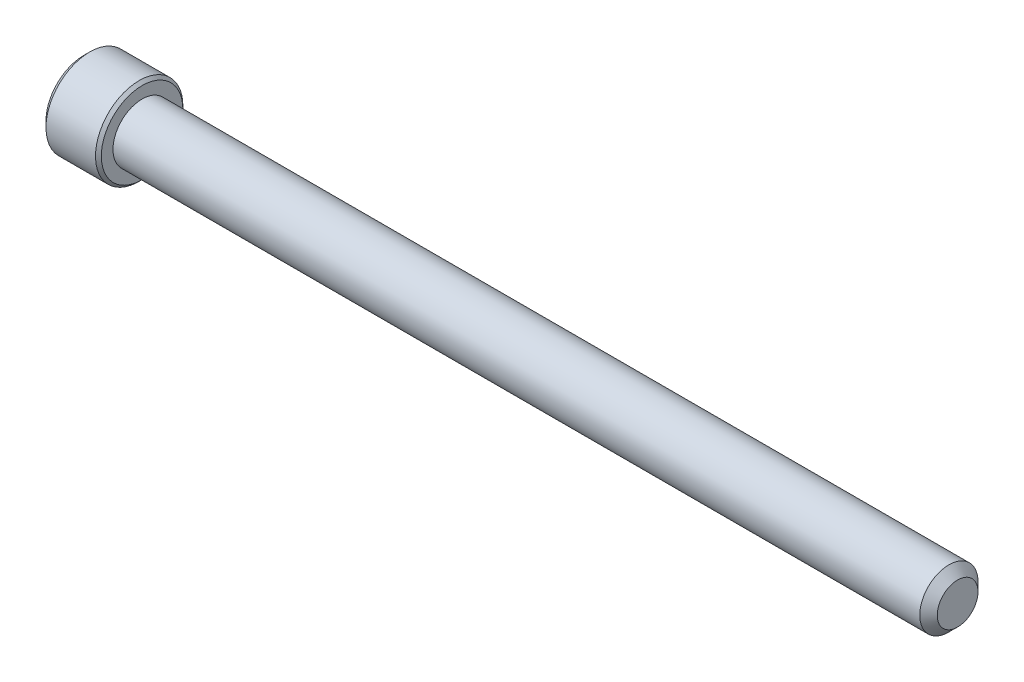
ISO-10303-21;
HEADER;
FILE_DESCRIPTION(('STEP AP214'),'2;1');
FILE_NAME('part.step','',(''),(''),'','','');
FILE_SCHEMA(('AUTOMOTIVE_DESIGN { 1 0 10303 214 1 1 1 1 }'));
ENDSEC;
DATA;
#1=APPLICATION_CONTEXT('core data for automotive mechanical design processes');
#2=APPLICATION_PROTOCOL_DEFINITION('international standard','automotive_design',2000,#1);
#3=PRODUCT_CONTEXT('',#1,'mechanical');
#4=PRODUCT('Part','Part','',(#3));
#5=PRODUCT_RELATED_PRODUCT_CATEGORY('part','',(#4));
#6=PRODUCT_DEFINITION_FORMATION('','',#4);
#7=PRODUCT_DEFINITION_CONTEXT('part definition',#1,'design');
#8=PRODUCT_DEFINITION('design','',#6,#7);
#9=PRODUCT_DEFINITION_SHAPE('','',#8);
#10=(LENGTH_UNIT() NAMED_UNIT(*) SI_UNIT(.MILLI.,.METRE.));
#11=(NAMED_UNIT(*) PLANE_ANGLE_UNIT() SI_UNIT($,.RADIAN.));
#12=(NAMED_UNIT(*) SI_UNIT($,.STERADIAN.) SOLID_ANGLE_UNIT());
#13=UNCERTAINTY_MEASURE_WITH_UNIT(LENGTH_MEASURE(1.E-05),#10,'distance_accuracy_value','');
#14=(GEOMETRIC_REPRESENTATION_CONTEXT(3) GLOBAL_UNCERTAINTY_ASSIGNED_CONTEXT((#13)) GLOBAL_UNIT_ASSIGNED_CONTEXT((#10,
#11,#12)) REPRESENTATION_CONTEXT('',''));
#15=CARTESIAN_POINT('',(0.,0.,0.));
#16=DIRECTION('',(0.,0.,1.));
#17=DIRECTION('',(1.,0.,0.));
#18=AXIS2_PLACEMENT_3D('',#15,#16,#17);
#19=CARTESIAN_POINT('',(-50.8,4.12749999999999,0.));
#20=DIRECTION('',(-1.,0.,0.));
#21=DIRECTION('',(0.,-1.,0.));
#22=AXIS2_PLACEMENT_3D('',#19,#20,#21);
#23=PLANE('',#22);
#24=CARTESIAN_POINT('',(-50.8,1.47904822880644E-13,0.));
#25=DIRECTION('',(-1.,0.,0.));
#26=DIRECTION('',(0.,-1.,0.));
#27=AXIS2_PLACEMENT_3D('',#24,#25,#26);
#28=CIRCLE('',#27,2.74963065701552);
#29=CARTESIAN_POINT('',(-50.8,-2.74963065701537,-3.89011739487799E-13));
#30=VERTEX_POINT('',#29);
#31=CARTESIAN_POINT('',(-50.8,-1.37481532850795,2.38124999999974));
#32=VERTEX_POINT('',#31);
#33=EDGE_CURVE('E132',#30,#32,#28,.T.);
#34=ORIENTED_EDGE('',*,*,#33,.F.);
#35=CARTESIAN_POINT('',(-50.8,-1.3748153285078,-2.38125));
#36=VERTEX_POINT('',#35);
#37=EDGE_CURVE('E131',#36,#30,#28,.T.);
#38=ORIENTED_EDGE('',*,*,#37,.F.);
#39=CARTESIAN_POINT('',(-50.8,1.37481532850779,-2.38125));
#40=VERTEX_POINT('',#39);
#41=EDGE_CURVE('E101',#40,#36,#28,.T.);
#42=ORIENTED_EDGE('',*,*,#41,.F.);
#43=CARTESIAN_POINT('',(-50.8,2.74963065701566,-1.22514845490862E-13));
#44=VERTEX_POINT('',#43);
#45=EDGE_CURVE('E94',#44,#40,#28,.T.);
#46=ORIENTED_EDGE('',*,*,#45,.F.);
#47=CARTESIAN_POINT('',(-50.8,1.37481532850779,2.38125));
#48=VERTEX_POINT('',#47);
#49=EDGE_CURVE('E55',#48,#44,#28,.T.);
#50=ORIENTED_EDGE('',*,*,#49,.F.);
#51=EDGE_CURVE('E62',#32,#48,#28,.T.);
#52=ORIENTED_EDGE('',*,*,#51,.F.);
#53=EDGE_LOOP('',(#34,#38,#42,#46,#50,#52));
#54=FACE_BOUND('',#53,.T.);
#55=CARTESIAN_POINT('',(-50.8,0.,0.));
#56=DIRECTION('',(1.,0.,0.));
#57=DIRECTION('',(0.,1.,0.));
#58=AXIS2_PLACEMENT_3D('',#55,#56,#57);
#59=CIRCLE('',#58,4.1275);
#60=CARTESIAN_POINT('',(-50.8,4.12749999999999,0.));
#61=VERTEX_POINT('',#60);
#62=EDGE_CURVE('E225',#61,#61,#59,.T.);
#63=ORIENTED_EDGE('',*,*,#62,.F.);
#64=EDGE_LOOP('',(#63));
#65=FACE_BOUND('',#64,.T.);
#66=ADVANCED_FACE('F35',(#54,#65),#23,.T.);
#67=CARTESIAN_POINT('',(-44.45,0.,0.));
#68=DIRECTION('',(1.,0.,0.));
#69=DIRECTION('',(0.,0.,-1.));
#70=AXIS2_PLACEMENT_3D('',#67,#68,#69);
#71=CYLINDRICAL_SURFACE('',#70,3.17499999999999);
#72=CARTESIAN_POINT('',(43.4975,0.,0.));
#73=DIRECTION('',(1.,0.,0.));
#74=DIRECTION('',(0.,0.,-1.));
#75=AXIS2_PLACEMENT_3D('',#72,#73,#74);
#76=CIRCLE('',#75,3.17499999999999);
#77=CARTESIAN_POINT('',(43.4975,0.,-3.17499999999999));
#78=VERTEX_POINT('',#77);
#79=EDGE_CURVE('E49',#78,#78,#76,.F.);
#80=ORIENTED_EDGE('',*,*,#79,.T.);
#81=EDGE_LOOP('',(#80));
#82=FACE_BOUND('',#81,.T.);
#83=CARTESIAN_POINT('',(-44.45,0.,0.));
#84=DIRECTION('',(1.,0.,0.));
#85=DIRECTION('',(0.,1.,0.));
#86=AXIS2_PLACEMENT_3D('',#83,#84,#85);
#87=CIRCLE('',#86,3.17499999999999);
#88=CARTESIAN_POINT('',(-44.45,3.17499999999998,0.));
#89=VERTEX_POINT('',#88);
#90=EDGE_CURVE('E218',#89,#89,#87,.F.);
#91=ORIENTED_EDGE('',*,*,#90,.F.);
#92=EDGE_LOOP('',(#91));
#93=FACE_BOUND('',#92,.T.);
#94=ADVANCED_FACE('F198',(#82,#93),#71,.T.);
#95=CARTESIAN_POINT('',(44.45,0.,0.));
#96=DIRECTION('',(1.,0.,0.));
#97=DIRECTION('',(0.,0.,-1.));
#98=AXIS2_PLACEMENT_3D('',#95,#96,#97);
#99=PLANE('',#98);
#100=CARTESIAN_POINT('',(44.45,0.,0.));
#101=DIRECTION('',(1.,0.,0.));
#102=DIRECTION('',(0.,0.,-1.));
#103=AXIS2_PLACEMENT_3D('',#100,#101,#102);
#104=CIRCLE('',#103,2.22249999999999);
#105=CARTESIAN_POINT('',(44.45,0.,-2.22249999999999));
#106=VERTEX_POINT('',#105);
#107=EDGE_CURVE('E219',#106,#106,#104,.T.);
#108=ORIENTED_EDGE('',*,*,#107,.T.);
#109=EDGE_LOOP('',(#108));
#110=FACE_BOUND('',#109,.T.);
#111=ADVANCED_FACE('F206',(#110),#99,.T.);
#112=CARTESIAN_POINT('',(44.45,0.,0.));
#113=DIRECTION('',(-1.,0.,0.));
#114=DIRECTION('',(0.,0.,1.));
#115=AXIS2_PLACEMENT_3D('',#112,#113,#114);
#116=CONICAL_SURFACE('',#115,2.22249999999999,0.785398163397453);
#117=ORIENTED_EDGE('',*,*,#79,.F.);
#118=EDGE_LOOP('',(#117));
#119=FACE_BOUND('',#118,.T.);
#120=ORIENTED_EDGE('',*,*,#107,.F.);
#121=EDGE_LOOP('',(#120));
#122=FACE_BOUND('',#121,.T.);
#123=ADVANCED_FACE('F37',(#119,#122),#116,.T.);
#124=CARTESIAN_POINT('',(-44.45,0.,0.));
#125=DIRECTION('',(1.,0.,0.));
#126=DIRECTION('',(0.,1.,0.));
#127=AXIS2_PLACEMENT_3D('',#124,#125,#126);
#128=CYLINDRICAL_SURFACE('',#127,4.7625);
#129=CARTESIAN_POINT('',(-50.165,0.,0.));
#130=DIRECTION('',(1.,0.,0.));
#131=DIRECTION('',(0.,1.,0.));
#132=AXIS2_PLACEMENT_3D('',#129,#130,#131);
#133=CIRCLE('',#132,4.7625);
#134=CARTESIAN_POINT('',(-50.165,4.76249999999999,0.));
#135=VERTEX_POINT('',#134);
#136=EDGE_CURVE('E220',#135,#135,#133,.T.);
#137=ORIENTED_EDGE('',*,*,#136,.T.);
#138=EDGE_LOOP('',(#137));
#139=FACE_BOUND('',#138,.T.);
#140=CARTESIAN_POINT('',(-44.7675,0.,0.));
#141=DIRECTION('',(1.,0.,0.));
#142=DIRECTION('',(0.,1.,0.));
#143=AXIS2_PLACEMENT_3D('',#140,#141,#142);
#144=CIRCLE('',#143,4.7625);
#145=CARTESIAN_POINT('',(-44.7675,4.76249999999999,0.));
#146=VERTEX_POINT('',#145);
#147=EDGE_CURVE('E233',#146,#146,#144,.T.);
#148=ORIENTED_EDGE('',*,*,#147,.F.);
#149=EDGE_LOOP('',(#148));
#150=FACE_BOUND('',#149,.T.);
#151=ADVANCED_FACE('F201',(#139,#150),#128,.T.);
#152=CARTESIAN_POINT('',(-50.165,0.,0.));
#153=DIRECTION('',(1.,0.,0.));
#154=DIRECTION('',(0.,1.,0.));
#155=AXIS2_PLACEMENT_3D('',#152,#153,#154);
#156=CONICAL_SURFACE('',#155,4.7625,0.785398163397455);
#157=ORIENTED_EDGE('',*,*,#62,.T.);
#158=EDGE_LOOP('',(#157));
#159=FACE_BOUND('',#158,.T.);
#160=ORIENTED_EDGE('',*,*,#136,.F.);
#161=EDGE_LOOP('',(#160));
#162=FACE_BOUND('',#161,.T.);
#163=ADVANCED_FACE('F194',(#159,#162),#156,.T.);
#164=CARTESIAN_POINT('',(-44.45,4.44499999999999,0.));
#165=DIRECTION('',(1.,0.,0.));
#166=DIRECTION('',(0.,1.,0.));
#167=AXIS2_PLACEMENT_3D('',#164,#165,#166);
#168=PLANE('',#167);
#169=ORIENTED_EDGE('',*,*,#90,.T.);
#170=EDGE_LOOP('',(#169));
#171=FACE_BOUND('',#170,.T.);
#172=CARTESIAN_POINT('',(-44.45,0.,0.));
#173=DIRECTION('',(1.,0.,0.));
#174=DIRECTION('',(0.,1.,0.));
#175=AXIS2_PLACEMENT_3D('',#172,#173,#174);
#176=CIRCLE('',#175,4.445);
#177=CARTESIAN_POINT('',(-44.45,4.44499999999999,0.));
#178=VERTEX_POINT('',#177);
#179=EDGE_CURVE('E230',#178,#178,#176,.T.);
#180=ORIENTED_EDGE('',*,*,#179,.T.);
#181=EDGE_LOOP('',(#180));
#182=FACE_BOUND('',#181,.T.);
#183=ADVANCED_FACE('F190',(#171,#182),#168,.T.);
#184=CARTESIAN_POINT('',(-44.45,0.,0.));
#185=DIRECTION('',(-1.,0.,0.));
#186=DIRECTION('',(0.,-1.,0.));
#187=AXIS2_PLACEMENT_3D('',#184,#185,#186);
#188=CONICAL_SURFACE('',#187,4.445,0.785398163397451);
#189=ORIENTED_EDGE('',*,*,#147,.T.);
#190=EDGE_LOOP('',(#189));
#191=FACE_BOUND('',#190,.T.);
#192=ORIENTED_EDGE('',*,*,#179,.F.);
#193=EDGE_LOOP('',(#192));
#194=FACE_BOUND('',#193,.T.);
#195=ADVANCED_FACE('F154',(#191,#194),#188,.T.);
#196=CARTESIAN_POINT('',(-50.8,1.47904822880644E-13,0.));
#197=DIRECTION('',(-1.,0.,0.));
#198=DIRECTION('',(0.,-1.,0.));
#199=AXIS2_PLACEMENT_3D('',#196,#197,#198);
#200=CONICAL_SURFACE('',#199,2.74963065701552,0.78539816339745);
#201=CARTESIAN_POINT('',(-51.697617086082,-2.76261914440425,-2.38125));
#202=CARTESIAN_POINT('',(-51.6467472146643,-2.69544479536907,-2.38125));
#203=CARTESIAN_POINT('',(-51.5963629455591,-2.62789666157828,-2.38125));
#204=CARTESIAN_POINT('',(-51.4967837708367,-2.49190448977624,-2.38125));
#205=CARTESIAN_POINT('',(-51.4475891640071,-2.42346023321907,-2.38125));
#206=CARTESIAN_POINT('',(-51.3502575507659,-2.28502676073676,-2.38125));
#207=CARTESIAN_POINT('',(-51.3021316856914,-2.21502968492298,-2.38125));
#208=CARTESIAN_POINT('',(-51.207655610134,-2.07385103549332,-2.38125));
#209=CARTESIAN_POINT('',(-51.1613052747741,-2.00266954568686,-2.38125));
#210=CARTESIAN_POINT('',(-51.0681368561697,-1.85474026844006,-2.38125));
#211=CARTESIAN_POINT('',(-51.0214491376501,-1.77790995637349,-2.38125));
#212=CARTESIAN_POINT('',(-50.9311296058592,-1.62247617017445,-2.38125));
#213=CARTESIAN_POINT('',(-50.8874973902756,-1.54387293128847,-2.38125));
#214=CARTESIAN_POINT('',(-50.8042071100283,-1.3848627213771,-2.38125));
#215=CARTESIAN_POINT('',(-50.7645379009363,-1.30446163393302,-2.38125));
#216=CARTESIAN_POINT('',(-50.6900690459264,-1.14145314547584,-2.38125));
#217=CARTESIAN_POINT('',(-50.6552671796136,-1.05884677109136,-2.38125));
#218=CARTESIAN_POINT('',(-50.594429813229,-0.898296083334491,-2.38125));
#219=CARTESIAN_POINT('',(-50.5679047139328,-0.820539229733685,-2.38125));
#220=CARTESIAN_POINT('',(-50.5210898392086,-0.663135380856678,-2.38125));
#221=CARTESIAN_POINT('',(-50.500800487612,-0.583488257498785,-2.38125));
#222=CARTESIAN_POINT('',(-50.4678604073913,-0.42411417709676,-2.38125));
#223=CARTESIAN_POINT('',(-50.4550775337026,-0.344414987504175,-2.38125));
#224=CARTESIAN_POINT('',(-50.4374018129256,-0.184141832361523,-2.38125));
#225=CARTESIAN_POINT('',(-50.4325075663142,-0.103568024531794,-2.38125));
#226=CARTESIAN_POINT('',(-50.4309814589762,0.0546452704452455,-2.38125));
#227=CARTESIAN_POINT('',(-50.4340477837949,0.132281935816241,-2.38125));
#228=CARTESIAN_POINT('',(-50.4476029014609,0.286899761817945,-2.38125));
#229=CARTESIAN_POINT('',(-50.4580924083037,0.363880858672191,-2.38125));
#230=CARTESIAN_POINT('',(-50.4860957916784,0.517934845552238,-2.38125));
#231=CARTESIAN_POINT('',(-50.5037299282364,0.594985552514308,-2.38125));
#232=CARTESIAN_POINT('',(-50.5450790150025,0.747397784971382,-2.38125));
#233=CARTESIAN_POINT('',(-50.5687934823661,0.822759444078687,-2.38125));
#234=CARTESIAN_POINT('',(-50.6521079749025,1.05910849740078,-2.38125));
#235=CARTESIAN_POINT('',(-50.7211581302676,1.21677702097605,-2.38125));
#236=CARTESIAN_POINT('',(-50.8362600462424,1.4475053891355,-2.38125));
#237=CARTESIAN_POINT('',(-50.8766390556527,1.52359597394734,-2.38125));
#238=CARTESIAN_POINT('',(-50.9605045047098,1.67404919579944,-2.38125));
#239=CARTESIAN_POINT('',(-51.0039903868604,1.74841213968931,-2.38125));
#240=CARTESIAN_POINT('',(-51.091219749271,1.89195740305355,-2.38125));
#241=CARTESIAN_POINT('',(-51.134843103173,1.96121355997418,-2.38125));
#242=CARTESIAN_POINT('',(-51.2239297072439,2.0985382616553,-2.38125));
#243=CARTESIAN_POINT('',(-51.2693930965357,2.16660671605613,-2.38125));
#244=CARTESIAN_POINT('',(-51.3614552844234,2.30115854912705,-2.38125));
#245=CARTESIAN_POINT('',(-51.4080418918462,2.3676503039009,-2.38125));
#246=CARTESIAN_POINT('',(-51.5024503249111,2.49972444191934,-2.38125));
#247=CARTESIAN_POINT('',(-51.5502718071541,2.5653070703449,-2.38125));
#248=CARTESIAN_POINT('',(-51.5985984122085,2.63050906958847,-2.38125));
#249=B_SPLINE_CURVE_WITH_KNOTS('',3,(#201,#202,#203,#204,#205,#206,#207,#208,#209,#210,#211,
#212,#213,#214,#215,#216,#217,#218,#219,#220,#221,#222,#223,#224,#225,#226,#227,#228,#229,#230,
#231,#232,#233,#234,#235,#236,#237,#238,#239,#240,#241,#242,#243,#244,#245,#246,#247,#248),
.UNSPECIFIED.,.F.,.F.,(4,2,2,2,2,2,2,2,2,2,2,2,2,2,2,2,2,2,2,2,2,2,2,4),(0.,0.252791871598845,
0.505646586890004,0.760459562213748,1.015254582946,1.2849090420233,1.55452792920376,
1.82336591151059,2.09208085189162,2.33833488227863,2.58460564635847,2.82639989379225,
3.06815123972689,3.30087188936546,3.53361492618327,3.77045005614666,4.00726638464229,
4.52203846871525,4.78044014408788,5.03879556784421,5.28431582225913,5.52985467496309,
5.77340315409188,6.01688462049009),.UNSPECIFIED.);
#250=EDGE_CURVE('E11',#36,#40,#249,.T.);
#251=ORIENTED_EDGE('',*,*,#250,.T.);
#252=ORIENTED_EDGE('',*,*,#41,.T.);
#253=EDGE_LOOP('',(#251,#252));
#254=FACE_BOUND('',#253,.T.);
#255=ADVANCED_FACE('F106',(#254),#200,.F.);
#256=CARTESIAN_POINT('',(-50.8001154773275,-2.74974612706943,0.000200000000001018));
#257=CARTESIAN_POINT('',(-50.7528948967097,-2.70248609172789,-0.0816567823790517));
#258=CARTESIAN_POINT('',(-50.7084475752931,-2.65443579722785,-0.164882333771765));
#259=CARTESIAN_POINT('',(-50.6270654569858,-2.55645590753599,-0.334588480838053));
#260=CARTESIAN_POINT('',(-50.5901759430953,-2.506516993425,-0.42108521735312));
#261=CARTESIAN_POINT('',(-50.5269834131661,-2.40581754748856,-0.595501774009069));
#262=CARTESIAN_POINT('',(-50.5005215587297,-2.35508266327637,-0.683377171180706));
#263=CARTESIAN_POINT('',(-50.4597515156163,-2.25249593653963,-0.861062594070917));
#264=CARTESIAN_POINT('',(-50.4454128915307,-2.20064722822082,-0.950867191185917));
#265=CARTESIAN_POINT('',(-50.4324757847703,-2.11128933452155,-1.10563960313039));
#266=CARTESIAN_POINT('',(-50.4305606046534,-2.07389560129141,-1.17040744896968));
#267=CARTESIAN_POINT('',(-50.4337866227679,-1.99916925388845,-1.29983727933564));
#268=CARTESIAN_POINT('',(-50.4389302948573,-1.96183666573618,-1.36449921879342));
#269=CARTESIAN_POINT('',(-50.4559813108718,-1.88752399013706,-1.49321254857747));
#270=CARTESIAN_POINT('',(-50.4678962213495,-1.85054434417196,-1.55726317423493));
#271=CARTESIAN_POINT('',(-50.4978356723522,-1.77722451768912,-1.68425683890536));
#272=CARTESIAN_POINT('',(-50.5158597445186,-1.74088428837512,-1.74719996243591));
#273=CARTESIAN_POINT('',(-50.5693688075526,-1.6478003051618,-1.90842615073226));
#274=CARTESIAN_POINT('',(-50.6088874208724,-1.59163374230434,-2.0057094912879));
#275=CARTESIAN_POINT('',(-50.675600343551,-1.50904576583586,-2.14875606262561));
#276=CARTESIAN_POINT('',(-50.6990402091115,-1.48182934348128,-2.19589628894399));
#277=CARTESIAN_POINT('',(-50.7480566766597,-1.42790064981105,-2.28930352636665));
#278=CARTESIAN_POINT('',(-50.773631966767,-1.40118808114505,-2.33557105249683));
#279=CARTESIAN_POINT('',(-50.8001154773274,-1.37469985845396,-2.38145));
#280=B_SPLINE_CURVE_WITH_KNOTS('',3,(#256,#257,#258,#259,#260,#261,#262,#263,#264,#265,#266,
#267,#268,#269,#270,#271,#272,#273,#274,#275,#276,#277,#278,#279),.UNSPECIFIED.,.F.,.F.,(4,2,2,
2,2,2,2,2,2,2,2,4),(0.,0.317196610611962,0.636241461041248,0.95021895062927,1.26340583824132,
1.48752413747852,1.71172100167756,1.93616888974092,2.16059957440847,2.51709639744768,
2.69486147369101,2.87251813383153),.UNSPECIFIED.);
#281=EDGE_CURVE('E134',#30,#36,#280,.T.);
#282=ORIENTED_EDGE('',*,*,#281,.T.);
#283=ORIENTED_EDGE('',*,*,#37,.T.);
#284=EDGE_LOOP('',(#282,#283));
#285=FACE_BOUND('',#284,.T.);
#286=ADVANCED_FACE('F153',(#285),#200,.F.);
#287=CARTESIAN_POINT('',(-50.8001154773274,-1.37469985845396,2.38145));
#288=CARTESIAN_POINT('',(-50.7528948967097,-1.4219598937955,2.29959321762095));
#289=CARTESIAN_POINT('',(-50.708447575293,-1.47001018829553,2.21636766622825));
#290=CARTESIAN_POINT('',(-50.6270654569857,-1.56799007798738,2.04666151916198));
#291=CARTESIAN_POINT('',(-50.5901759430953,-1.61792899209837,1.96016478264692));
#292=CARTESIAN_POINT('',(-50.5269834131661,-1.7186284380348,1.78574822599098));
#293=CARTESIAN_POINT('',(-50.5005215587297,-1.76936332224699,1.69787282881935));
#294=CARTESIAN_POINT('',(-50.4597515156162,-1.87195004898371,1.52018740592916));
#295=CARTESIAN_POINT('',(-50.4454128915307,-1.92379875730252,1.43038280881417));
#296=CARTESIAN_POINT('',(-50.4324757847703,-2.01315665100178,1.2756103968697));
#297=CARTESIAN_POINT('',(-50.4305606046534,-2.05055038423192,1.21084255103042));
#298=CARTESIAN_POINT('',(-50.4337866227679,-2.12527673163488,1.08141272066446));
#299=CARTESIAN_POINT('',(-50.4389302948573,-2.16260931978716,1.01675078120668));
#300=CARTESIAN_POINT('',(-50.4559813108718,-2.23692199538627,0.888037451422631));
#301=CARTESIAN_POINT('',(-50.4678962213495,-2.27390164135137,0.823986825765171));
#302=CARTESIAN_POINT('',(-50.4978356723522,-2.34722146783421,0.696993161094746));
#303=CARTESIAN_POINT('',(-50.5158597445187,-2.38356169714821,0.634050037564192));
#304=CARTESIAN_POINT('',(-50.5693688075526,-2.47664568036154,0.472823849267831));
#305=CARTESIAN_POINT('',(-50.6088874208724,-2.53281224321901,0.375540508712172));
#306=CARTESIAN_POINT('',(-50.675600343551,-2.61540021968751,0.232493937374437));
#307=CARTESIAN_POINT('',(-50.6990402091116,-2.64261664204209,0.18535371105604));
#308=CARTESIAN_POINT('',(-50.7480566766598,-2.69654533571233,0.0919464736333626));
#309=CARTESIAN_POINT('',(-50.7736319667671,-2.72325790437833,0.0456789475031789));
#310=CARTESIAN_POINT('',(-50.8001154773275,-2.74974612706943,-0.000199999999999217));
#311=B_SPLINE_CURVE_WITH_KNOTS('',3,(#287,#288,#289,#290,#291,#292,#293,#294,#295,#296,#297,
#298,#299,#300,#301,#302,#303,#304,#305,#306,#307,#308,#309,#310),.UNSPECIFIED.,.F.,.F.,(4,2,2,
2,2,2,2,2,2,2,2,4),(0.,0.317196610611931,0.636241461041185,0.950218950629172,1.26340583824119,
1.48752413747838,1.71172100167742,1.93616888974078,2.16059957440833,2.51709639744761,
2.69486147369098,2.87251813383153),.UNSPECIFIED.);
#312=EDGE_CURVE('E141',#32,#30,#311,.T.);
#313=ORIENTED_EDGE('',*,*,#312,.T.);
#314=ORIENTED_EDGE('',*,*,#33,.T.);
#315=EDGE_LOOP('',(#313,#314));
#316=FACE_BOUND('',#315,.T.);
#317=ADVANCED_FACE('F266',(#316),#200,.F.);
#318=CARTESIAN_POINT('',(-51.6976170859108,-2.76261914417831,2.38125));
#319=CARTESIAN_POINT('',(-51.6467472144997,-2.6954447951495,2.38125));
#320=CARTESIAN_POINT('',(-51.5963629454012,-2.6278966613651,2.38125));
#321=CARTESIAN_POINT('',(-51.4967837706918,-2.49190448957592,2.38125));
#322=CARTESIAN_POINT('',(-51.4475891638689,-2.4234602330252,2.38125));
#323=CARTESIAN_POINT('',(-51.3502575506408,-2.28502676055601,2.38125));
#324=CARTESIAN_POINT('',(-51.3021316855729,-2.2150296847489,2.38125));
#325=CARTESIAN_POINT('',(-51.2076556100285,-2.07385103533271,2.38125));
#326=CARTESIAN_POINT('',(-51.1613052746752,-2.00266954553304,2.38125));
#327=CARTESIAN_POINT('',(-51.0681368560842,-1.8547402683009,2.38125));
#328=CARTESIAN_POINT('',(-51.0214491375716,-1.77790995624221,2.38125));
#329=CARTESIAN_POINT('',(-50.9311296057944,-1.6224761700592,2.38125));
#330=CARTESIAN_POINT('',(-50.8874973902175,-1.54387293118138,2.38125));
#331=CARTESIAN_POINT('',(-50.804207109983,-1.38486272128662,2.38125));
#332=CARTESIAN_POINT('',(-50.764537900897,-1.304461633851,2.38125));
#333=CARTESIAN_POINT('',(-50.6900690458986,-1.14145314541117,2.38125));
#334=CARTESIAN_POINT('',(-50.6552671795912,-1.0588467710356,2.38125));
#335=CARTESIAN_POINT('',(-50.5944298132106,-0.898296083282554,2.38125));
#336=CARTESIAN_POINT('',(-50.5679047139139,-0.820539229676276,2.38125));
#337=CARTESIAN_POINT('',(-50.52108983919,-0.66313538078814,2.38125));
#338=CARTESIAN_POINT('',(-50.5008004875941,-0.583488257424592,2.38125));
#339=CARTESIAN_POINT('',(-50.4678604073762,-0.424114177011439,2.38125));
#340=CARTESIAN_POINT('',(-50.4550775336894,-0.344414987413386,2.38125));
#341=CARTESIAN_POINT('',(-50.4374018129175,-0.184141832259972,2.38125));
#342=CARTESIAN_POINT('',(-50.4325075663093,-0.10356802442495,2.38125));
#343=CARTESIAN_POINT('',(-50.4309814589787,0.0546452705617246,2.38125));
#344=CARTESIAN_POINT('',(-50.4340477838015,0.132281935937076,2.38125));
#345=CARTESIAN_POINT('',(-50.4476029014762,0.286899761947049,2.38125));
#346=CARTESIAN_POINT('',(-50.4580924083237,0.363880858805207,2.38125));
#347=CARTESIAN_POINT('',(-50.4860957917083,0.517934845692977,2.38125));
#348=CARTESIAN_POINT('',(-50.5037299282714,0.594985552658845,2.38125));
#349=CARTESIAN_POINT('',(-50.5450790150479,0.747397785123144,2.38125));
#350=CARTESIAN_POINT('',(-50.5687934824168,0.822759444233876,2.38125));
#351=CARTESIAN_POINT('',(-50.6521079749779,1.05910849758962,2.38125));
#352=CARTESIAN_POINT('',(-50.7211581303658,1.21677702119343,2.38125));
#353=CARTESIAN_POINT('',(-50.8362600463765,1.44750538939399,2.38125));
#354=CARTESIAN_POINT('',(-50.8766390557991,1.52359597421928,2.38125));
#355=CARTESIAN_POINT('',(-50.9605045048813,1.67404919609787,2.38125));
#356=CARTESIAN_POINT('',(-51.0039903870446,1.74841214000077,2.38125));
#357=CARTESIAN_POINT('',(-51.0912197494795,1.89195740338868,2.38125));
#358=CARTESIAN_POINT('',(-51.1348431033928,1.96121356032,2.38125));
#359=CARTESIAN_POINT('',(-51.2239297074865,2.09853826202233,2.38125));
#360=CARTESIAN_POINT('',(-51.2693930967897,2.1666067164337,2.38125));
#361=CARTESIAN_POINT('',(-51.3614552847003,2.30115854952543,2.38125));
#362=CARTESIAN_POINT('',(-51.4080418921344,2.36765030430956,2.38125));
#363=CARTESIAN_POINT('',(-51.5024503252218,2.4997244423485,2.38125));
#364=CARTESIAN_POINT('',(-51.5502718074761,2.56530707078428,2.38125));
#365=CARTESIAN_POINT('',(-51.5985984125418,2.63050907003805,2.38125));
#366=B_SPLINE_CURVE_WITH_KNOTS('',3,(#318,#319,#320,#321,#322,#323,#324,#325,#326,#327,#328,
#329,#330,#331,#332,#333,#334,#335,#336,#337,#338,#339,#340,#341,#342,#343,#344,#345,#346,#347,
#348,#349,#350,#351,#352,#353,#354,#355,#356,#357,#358,#359,#360,#361,#362,#363,#364,#365),
.UNSPECIFIED.,.F.,.F.,(4,2,2,2,2,2,2,2,2,2,2,2,2,2,2,2,2,2,2,2,2,2,2,4),(0.,0.252791871571654,
0.505646586835623,0.760459562131666,1.01525458283622,1.28490904188242,1.55452792903179,
1.82336591130779,2.09208085165803,2.3383348820609,2.58460564615657,2.82639989360552,
3.06815123955534,3.30087188920739,3.5336149260387,3.77045005601664,4.00726638452682,
4.52203846870511,4.78044014413077,5.03879556794011,5.28431582240037,5.52985467514967,
5.77340315432319,6.01688462076612),.UNSPECIFIED.);
#367=EDGE_CURVE('E161',#48,#32,#366,.F.);
#368=ORIENTED_EDGE('',*,*,#367,.T.);
#369=ORIENTED_EDGE('',*,*,#51,.T.);
#370=EDGE_LOOP('',(#368,#369));
#371=FACE_BOUND('',#370,.T.);
#372=ADVANCED_FACE('F282',(#371),#200,.F.);
#373=CARTESIAN_POINT('',(-50.8001154773271,2.74974612706943,-0.000199999999999819));
#374=CARTESIAN_POINT('',(-50.7528948967094,2.70248609172789,0.081656782379047));
#375=CARTESIAN_POINT('',(-50.7084475752928,2.65443579722786,0.164882333771752));
#376=CARTESIAN_POINT('',(-50.6270654569855,2.55645590753601,0.334588480838023));
#377=CARTESIAN_POINT('',(-50.590175943095,2.50651699342502,0.421085217353081));
#378=CARTESIAN_POINT('',(-50.5269834131658,2.40581754748859,0.595501774009012));
#379=CARTESIAN_POINT('',(-50.5005215587294,2.3550826632764,0.683377171180641));
#380=CARTESIAN_POINT('',(-50.459751515616,2.25249593653968,0.861062594070832));
#381=CARTESIAN_POINT('',(-50.4454128915305,2.20064722822087,0.950867191185822));
#382=CARTESIAN_POINT('',(-50.43247578477,2.11128933452161,1.10563960313028));
#383=CARTESIAN_POINT('',(-50.4305606046531,2.07389560129148,1.17040744896956));
#384=CARTESIAN_POINT('',(-50.4337866227676,1.99916925388853,1.29983727933551));
#385=CARTESIAN_POINT('',(-50.438930294857,1.96183666573626,1.36449921879328));
#386=CARTESIAN_POINT('',(-50.4559813108716,1.88752399013715,1.49321254857732));
#387=CARTESIAN_POINT('',(-50.4678962213493,1.85054434417206,1.55726317423477));
#388=CARTESIAN_POINT('',(-50.497835672352,1.77722451768922,1.68425683890519));
#389=CARTESIAN_POINT('',(-50.5158597445184,1.74088428837522,1.74719996243573));
#390=CARTESIAN_POINT('',(-50.5693688075523,1.64780030516189,1.90842615073211));
#391=CARTESIAN_POINT('',(-50.6088874208721,1.59163374230441,2.00570949128778));
#392=CARTESIAN_POINT('',(-50.6756003435507,1.5090457658359,2.14875606262553));
#393=CARTESIAN_POINT('',(-50.6990402091113,1.48182934348131,2.19589628894394));
#394=CARTESIAN_POINT('',(-50.7480566766595,1.42790064981106,2.28930352636663));
#395=CARTESIAN_POINT('',(-50.7736319667668,1.40118808114506,2.33557105249682));
#396=CARTESIAN_POINT('',(-50.8001154773272,1.37469985845396,2.38145));
#397=B_SPLINE_CURVE_WITH_KNOTS('',3,(#373,#374,#375,#376,#377,#378,#379,#380,#381,#382,#383,
#384,#385,#386,#387,#388,#389,#390,#391,#392,#393,#394,#395,#396),.UNSPECIFIED.,.F.,.F.,(4,2,2,
2,2,2,2,2,2,2,2,4),(0.,0.317196610611932,0.636241461041188,0.950218950629173,1.26340583824119,
1.48752413747836,1.71172100167738,1.93616888974072,2.16059957440825,2.51709639744758,
2.69486147369097,2.87251813383155),.UNSPECIFIED.);
#398=EDGE_CURVE('E121',#44,#48,#397,.T.);
#399=ORIENTED_EDGE('',*,*,#398,.T.);
#400=ORIENTED_EDGE('',*,*,#49,.T.);
#401=EDGE_LOOP('',(#399,#400));
#402=FACE_BOUND('',#401,.T.);
#403=ADVANCED_FACE('F258',(#402),#200,.F.);
#404=CARTESIAN_POINT('',(-50.8001154773272,1.37469985845396,-2.38145));
#405=CARTESIAN_POINT('',(-50.7528948967095,1.4219598937955,-2.29959321762095));
#406=CARTESIAN_POINT('',(-50.7084475752929,1.47001018829554,-2.21636766622823));
#407=CARTESIAN_POINT('',(-50.6270654569855,1.56799007798739,-2.04666151916195));
#408=CARTESIAN_POINT('',(-50.5901759430951,1.61792899209839,-1.96016478264688));
#409=CARTESIAN_POINT('',(-50.5269834131659,1.71862843803483,-1.78574822599093));
#410=CARTESIAN_POINT('',(-50.5005215587294,1.76936332224702,-1.6978728288193));
#411=CARTESIAN_POINT('',(-50.459751515616,1.87195004898375,-1.52018740592909));
#412=CARTESIAN_POINT('',(-50.4454128915305,1.92379875730256,-1.43038280881409));
#413=CARTESIAN_POINT('',(-50.43247578477,2.01315665100183,-1.27561039686962));
#414=CARTESIAN_POINT('',(-50.4305606046531,2.05055038423197,-1.21084255103034));
#415=CARTESIAN_POINT('',(-50.4337866227676,2.12527673163492,-1.08141272066439));
#416=CARTESIAN_POINT('',(-50.438930294857,2.16260931978719,-1.01675078120661));
#417=CARTESIAN_POINT('',(-50.4559813108716,2.2369219953863,-0.888037451422579));
#418=CARTESIAN_POINT('',(-50.4678962213493,2.27390164135139,-0.823986825765125));
#419=CARTESIAN_POINT('',(-50.4978356723519,2.34722146783423,-0.696993161094711));
#420=CARTESIAN_POINT('',(-50.5158597445184,2.38356169714823,-0.634050037564163));
#421=CARTESIAN_POINT('',(-50.5693688075523,2.47664568036155,-0.47282384926781));
#422=CARTESIAN_POINT('',(-50.6088874208721,2.53281224321902,-0.375540508712153));
#423=CARTESIAN_POINT('',(-50.6756003435507,2.61540021968751,-0.232493937374425));
#424=CARTESIAN_POINT('',(-50.6990402091112,2.6426166420421,-0.185353711056032));
#425=CARTESIAN_POINT('',(-50.7480566766594,2.69654533571233,-0.0919464736333599));
#426=CARTESIAN_POINT('',(-50.7736319667668,2.72325790437833,-0.0456789475031777));
#427=CARTESIAN_POINT('',(-50.8001154773271,2.74974612706943,0.000200000000000693));
#428=B_SPLINE_CURVE_WITH_KNOTS('',3,(#404,#405,#406,#407,#408,#409,#410,#411,#412,#413,#414,
#415,#416,#417,#418,#419,#420,#421,#422,#423,#424,#425,#426,#427),.UNSPECIFIED.,.F.,.F.,(4,2,2,
2,2,2,2,2,2,2,2,4),(0.,0.317196610611969,0.636241461041255,0.950218950629272,1.26340583824133,
1.4875241374785,1.71172100167752,1.93616888974085,2.16059957440839,2.51709639744765,
2.694861473691,2.87251813383155),.UNSPECIFIED.);
#429=EDGE_CURVE('E97',#40,#44,#428,.T.);
#430=ORIENTED_EDGE('',*,*,#429,.T.);
#431=ORIENTED_EDGE('',*,*,#45,.T.);
#432=EDGE_LOOP('',(#430,#431));
#433=FACE_BOUND('',#432,.T.);
#434=ADVANCED_FACE('F95',(#433),#200,.F.);
#435=CARTESIAN_POINT('',(-47.752,2.74963065701559,0.));
#436=DIRECTION('',(1.,0.,0.));
#437=DIRECTION('',(0.,0.,-1.));
#438=AXIS2_PLACEMENT_3D('',#435,#436,#437);
#439=PLANE('',#438);
#440=DIRECTION('',(0.,0.5,0.866025403784439));
#441=VECTOR('',#440,1.);
#442=CARTESIAN_POINT('',(-47.752,1.3748153285078,-2.38125));
#443=LINE('',#442,#441);
#444=CARTESIAN_POINT('',(-47.752,1.3748153285078,-2.38125));
#445=VERTEX_POINT('',#444);
#446=CARTESIAN_POINT('',(-47.752,2.74963065701559,0.));
#447=VERTEX_POINT('',#446);
#448=EDGE_CURVE('E120',#445,#447,#443,.T.);
#449=ORIENTED_EDGE('',*,*,#448,.F.);
#450=DIRECTION('',(0.,1.,0.));
#451=VECTOR('',#450,1.);
#452=CARTESIAN_POINT('',(-47.752,-1.3748153285078,-2.38125));
#453=LINE('',#452,#451);
#454=CARTESIAN_POINT('',(-47.752,-1.3748153285078,-2.38125));
#455=VERTEX_POINT('',#454);
#456=EDGE_CURVE('E125',#455,#445,#453,.T.);
#457=ORIENTED_EDGE('',*,*,#456,.F.);
#458=DIRECTION('',(0.,0.5,-0.866025403784439));
#459=VECTOR('',#458,1.);
#460=CARTESIAN_POINT('',(-47.752,-2.74963065701559,0.));
#461=LINE('',#460,#459);
#462=CARTESIAN_POINT('',(-47.752,-2.74963065701559,0.));
#463=VERTEX_POINT('',#462);
#464=EDGE_CURVE('E248',#463,#455,#461,.T.);
#465=ORIENTED_EDGE('',*,*,#464,.F.);
#466=DIRECTION('',(0.,-0.5,-0.866025403784439));
#467=VECTOR('',#466,1.);
#468=CARTESIAN_POINT('',(-47.752,-1.3748153285078,2.38125));
#469=LINE('',#468,#467);
#470=CARTESIAN_POINT('',(-47.752,-1.3748153285078,2.38125));
#471=VERTEX_POINT('',#470);
#472=EDGE_CURVE('E250',#471,#463,#469,.T.);
#473=ORIENTED_EDGE('',*,*,#472,.F.);
#474=DIRECTION('',(0.,-1.,0.));
#475=VECTOR('',#474,1.);
#476=CARTESIAN_POINT('',(-47.752,1.3748153285078,2.38125));
#477=LINE('',#476,#475);
#478=CARTESIAN_POINT('',(-47.752,1.3748153285078,2.38125));
#479=VERTEX_POINT('',#478);
#480=EDGE_CURVE('E252',#479,#471,#477,.T.);
#481=ORIENTED_EDGE('',*,*,#480,.F.);
#482=DIRECTION('',(0.,-0.5,0.866025403784439));
#483=VECTOR('',#482,1.);
#484=CARTESIAN_POINT('',(-47.752,2.74963065701559,0.));
#485=LINE('',#484,#483);
#486=EDGE_CURVE('E254',#447,#479,#485,.T.);
#487=ORIENTED_EDGE('',*,*,#486,.F.);
#488=EDGE_LOOP('',(#449,#457,#465,#473,#481,#487));
#489=FACE_BOUND('',#488,.T.);
#490=ADVANCED_FACE('F155',(#489),#439,.F.);
#491=CARTESIAN_POINT('',(-47.752,-1.3748153285078,-2.38125));
#492=DIRECTION('',(0.,0.,1.));
#493=DIRECTION('',(0.,-1.,0.));
#494=AXIS2_PLACEMENT_3D('',#491,#492,#493);
#495=PLANE('',#494);
#496=ORIENTED_EDGE('',*,*,#250,.F.);
#497=DIRECTION('',(-1.,0.,0.));
#498=VECTOR('',#497,1.);
#499=CARTESIAN_POINT('',(-47.752,-1.3748153285078,-2.38125));
#500=LINE('',#499,#498);
#501=EDGE_CURVE('E126',#455,#36,#500,.T.);
#502=ORIENTED_EDGE('',*,*,#501,.F.);
#503=ORIENTED_EDGE('',*,*,#456,.T.);
#504=DIRECTION('',(-1.,0.,0.));
#505=VECTOR('',#504,1.);
#506=CARTESIAN_POINT('',(-47.752,1.3748153285078,-2.38125));
#507=LINE('',#506,#505);
#508=EDGE_CURVE('E116',#445,#40,#507,.T.);
#509=ORIENTED_EDGE('',*,*,#508,.T.);
#510=EDGE_LOOP('',(#496,#502,#503,#509));
#511=FACE_BOUND('',#510,.T.);
#512=ADVANCED_FACE('F123',(#511),#495,.T.);
#513=CARTESIAN_POINT('',(-47.752,-2.74963065701559,0.));
#514=DIRECTION('',(0.,0.866025403784439,0.5));
#515=DIRECTION('',(0.,-0.5,0.866025403784439));
#516=AXIS2_PLACEMENT_3D('',#513,#514,#515);
#517=PLANE('',#516);
#518=ORIENTED_EDGE('',*,*,#281,.F.);
#519=DIRECTION('',(-1.,0.,0.));
#520=VECTOR('',#519,1.);
#521=CARTESIAN_POINT('',(-47.752,-2.74963065701559,0.));
#522=LINE('',#521,#520);
#523=EDGE_CURVE('E243',#463,#30,#522,.T.);
#524=ORIENTED_EDGE('',*,*,#523,.F.);
#525=ORIENTED_EDGE('',*,*,#464,.T.);
#526=ORIENTED_EDGE('',*,*,#501,.T.);
#527=EDGE_LOOP('',(#518,#524,#525,#526));
#528=FACE_BOUND('',#527,.T.);
#529=ADVANCED_FACE('F148',(#528),#517,.T.);
#530=CARTESIAN_POINT('',(-47.752,-1.3748153285078,2.38125));
#531=DIRECTION('',(0.,0.866025403784439,-0.5));
#532=DIRECTION('',(0.,0.5,0.866025403784439));
#533=AXIS2_PLACEMENT_3D('',#530,#531,#532);
#534=PLANE('',#533);
#535=ORIENTED_EDGE('',*,*,#312,.F.);
#536=DIRECTION('',(-1.,0.,0.));
#537=VECTOR('',#536,1.);
#538=CARTESIAN_POINT('',(-47.752,-1.3748153285078,2.38125));
#539=LINE('',#538,#537);
#540=EDGE_CURVE('E240',#471,#32,#539,.T.);
#541=ORIENTED_EDGE('',*,*,#540,.F.);
#542=ORIENTED_EDGE('',*,*,#472,.T.);
#543=ORIENTED_EDGE('',*,*,#523,.T.);
#544=EDGE_LOOP('',(#535,#541,#542,#543));
#545=FACE_BOUND('',#544,.T.);
#546=ADVANCED_FACE('F272',(#545),#534,.T.);
#547=CARTESIAN_POINT('',(-47.752,1.3748153285078,2.38125));
#548=DIRECTION('',(0.,0.,-1.));
#549=DIRECTION('',(0.,1.,0.));
#550=AXIS2_PLACEMENT_3D('',#547,#548,#549);
#551=PLANE('',#550);
#552=ORIENTED_EDGE('',*,*,#367,.F.);
#553=DIRECTION('',(-1.,0.,0.));
#554=VECTOR('',#553,1.);
#555=CARTESIAN_POINT('',(-47.752,1.3748153285078,2.38125));
#556=LINE('',#555,#554);
#557=EDGE_CURVE('E237',#479,#48,#556,.T.);
#558=ORIENTED_EDGE('',*,*,#557,.F.);
#559=ORIENTED_EDGE('',*,*,#480,.T.);
#560=ORIENTED_EDGE('',*,*,#540,.T.);
#561=EDGE_LOOP('',(#552,#558,#559,#560));
#562=FACE_BOUND('',#561,.T.);
#563=ADVANCED_FACE('F182',(#562),#551,.T.);
#564=CARTESIAN_POINT('',(-47.752,2.74963065701559,0.));
#565=DIRECTION('',(0.,-0.866025403784439,-0.5));
#566=DIRECTION('',(0.,0.5,-0.866025403784439));
#567=AXIS2_PLACEMENT_3D('',#564,#565,#566);
#568=PLANE('',#567);
#569=ORIENTED_EDGE('',*,*,#398,.F.);
#570=DIRECTION('',(-1.,0.,0.));
#571=VECTOR('',#570,1.);
#572=CARTESIAN_POINT('',(-47.752,2.74963065701559,0.));
#573=LINE('',#572,#571);
#574=EDGE_CURVE('E119',#447,#44,#573,.T.);
#575=ORIENTED_EDGE('',*,*,#574,.F.);
#576=ORIENTED_EDGE('',*,*,#486,.T.);
#577=ORIENTED_EDGE('',*,*,#557,.T.);
#578=EDGE_LOOP('',(#569,#575,#576,#577));
#579=FACE_BOUND('',#578,.T.);
#580=ADVANCED_FACE('F179',(#579),#568,.T.);
#581=CARTESIAN_POINT('',(-47.752,1.3748153285078,-2.38125));
#582=DIRECTION('',(0.,-0.866025403784439,0.5));
#583=DIRECTION('',(0.,-0.5,-0.866025403784439));
#584=AXIS2_PLACEMENT_3D('',#581,#582,#583);
#585=PLANE('',#584);
#586=ORIENTED_EDGE('',*,*,#429,.F.);
#587=ORIENTED_EDGE('',*,*,#508,.F.);
#588=ORIENTED_EDGE('',*,*,#448,.T.);
#589=ORIENTED_EDGE('',*,*,#574,.T.);
#590=EDGE_LOOP('',(#586,#587,#588,#589));
#591=FACE_BOUND('',#590,.T.);
#592=ADVANCED_FACE('F114',(#591),#585,.T.);
#593=CLOSED_SHELL('',(#66,#94,#111,#123,#151,#163,#183,#195,#255,#286,#317,#372,#403,#434,#490,
#512,#529,#546,#563,#580,#592));
#594=MANIFOLD_SOLID_BREP('B2',#593);
#595=ADVANCED_BREP_SHAPE_REPRESENTATION('',(#18,#594),#14);
#596=SHAPE_DEFINITION_REPRESENTATION(#9,#595);
ENDSEC;
END-ISO-10303-21;
